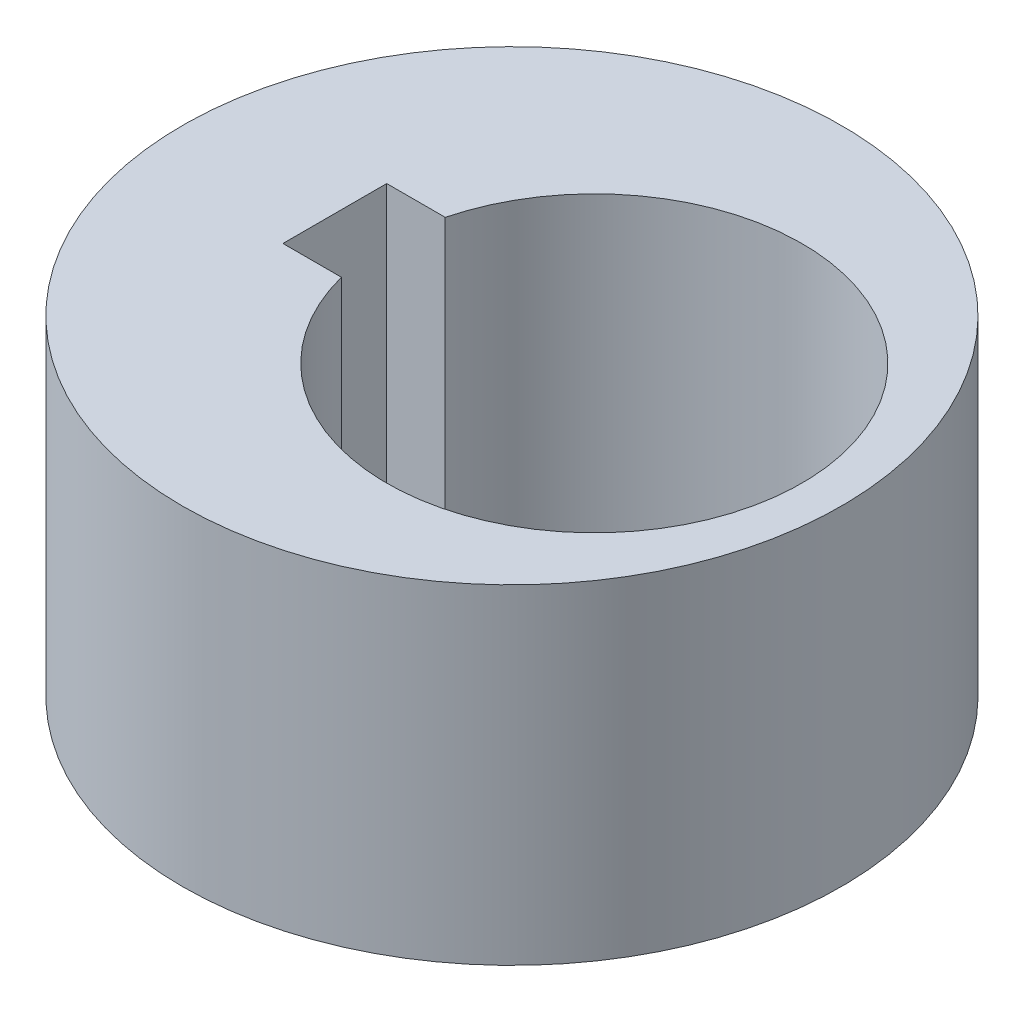
ISO-10303-21;
HEADER;
FILE_DESCRIPTION(('STEP AP214'),'2;1');
FILE_NAME('part.step','',(''),(''),'','','');
FILE_SCHEMA(('AUTOMOTIVE_DESIGN { 1 0 10303 214 1 1 1 1 }'));
ENDSEC;
DATA;
#1=APPLICATION_CONTEXT('core data for automotive mechanical design processes');
#2=APPLICATION_PROTOCOL_DEFINITION('international standard','automotive_design',2000,#1);
#3=PRODUCT_CONTEXT('',#1,'mechanical');
#4=PRODUCT('Part','Part','',(#3));
#5=PRODUCT_RELATED_PRODUCT_CATEGORY('part','',(#4));
#6=PRODUCT_DEFINITION_FORMATION('','',#4);
#7=PRODUCT_DEFINITION_CONTEXT('part definition',#1,'design');
#8=PRODUCT_DEFINITION('design','',#6,#7);
#9=PRODUCT_DEFINITION_SHAPE('','',#8);
#10=(LENGTH_UNIT() NAMED_UNIT(*) SI_UNIT(.MILLI.,.METRE.));
#11=(NAMED_UNIT(*) PLANE_ANGLE_UNIT() SI_UNIT($,.RADIAN.));
#12=(NAMED_UNIT(*) SI_UNIT($,.STERADIAN.) SOLID_ANGLE_UNIT());
#13=UNCERTAINTY_MEASURE_WITH_UNIT(LENGTH_MEASURE(1.E-05),#10,'distance_accuracy_value','');
#14=(GEOMETRIC_REPRESENTATION_CONTEXT(3) GLOBAL_UNCERTAINTY_ASSIGNED_CONTEXT((#13)) GLOBAL_UNIT_ASSIGNED_CONTEXT((#10,
#11,#12)) REPRESENTATION_CONTEXT('',''));
#15=CARTESIAN_POINT('',(0.,0.,0.));
#16=DIRECTION('',(0.,0.,1.));
#17=DIRECTION('',(1.,0.,0.));
#18=AXIS2_PLACEMENT_3D('',#15,#16,#17);
#19=CARTESIAN_POINT('',(0.,6.35,0.));
#20=DIRECTION('',(0.,-1.,0.));
#21=DIRECTION('',(0.,0.,-1.));
#22=AXIS2_PLACEMENT_3D('',#19,#20,#21);
#23=CYLINDRICAL_SURFACE('',#22,6.35);
#24=CARTESIAN_POINT('',(0.,6.35,0.));
#25=DIRECTION('',(0.,1.,0.));
#26=DIRECTION('',(0.,0.,1.));
#27=AXIS2_PLACEMENT_3D('',#24,#25,#26);
#28=CIRCLE('',#27,6.35);
#29=CARTESIAN_POINT('',(0.,6.35,6.35));
#30=VERTEX_POINT('',#29);
#31=EDGE_CURVE('E122',#30,#30,#28,.T.);
#32=ORIENTED_EDGE('',*,*,#31,.F.);
#33=EDGE_LOOP('',(#32));
#34=FACE_BOUND('',#33,.T.);
#35=CARTESIAN_POINT('',(0.,0.,0.));
#36=DIRECTION('',(0.,1.,0.));
#37=DIRECTION('',(0.,0.,1.));
#38=AXIS2_PLACEMENT_3D('',#35,#36,#37);
#39=CIRCLE('',#38,6.35);
#40=CARTESIAN_POINT('',(0.,0.,6.35));
#41=VERTEX_POINT('',#40);
#42=EDGE_CURVE('E118',#41,#41,#39,.T.);
#43=ORIENTED_EDGE('',*,*,#42,.T.);
#44=EDGE_LOOP('',(#43));
#45=FACE_BOUND('',#44,.T.);
#46=ADVANCED_FACE('F39',(#34,#45),#23,.T.);
#47=CARTESIAN_POINT('',(0.,6.35,0.));
#48=DIRECTION('',(0.,1.,0.));
#49=DIRECTION('',(0.,0.,1.));
#50=AXIS2_PLACEMENT_3D('',#47,#48,#49);
#51=PLANE('',#50);
#52=DIRECTION('',(1.,0.,0.));
#53=VECTOR('',#52,1.);
#54=CARTESIAN_POINT('',(-3.4125,6.35,1.));
#55=LINE('',#54,#53);
#56=CARTESIAN_POINT('',(-3.4125,6.35,1.));
#57=VERTEX_POINT('',#56);
#58=CARTESIAN_POINT('',(-2.28548334620742,6.35,1.));
#59=VERTEX_POINT('',#58);
#60=EDGE_CURVE('E101',#57,#59,#55,.T.);
#61=ORIENTED_EDGE('',*,*,#60,.F.);
#62=DIRECTION('',(0.,0.,1.));
#63=VECTOR('',#62,1.);
#64=CARTESIAN_POINT('',(-3.4125,6.35,1.));
#65=LINE('',#64,#63);
#66=CARTESIAN_POINT('',(-3.4125,6.35,-1.));
#67=VERTEX_POINT('',#66);
#68=EDGE_CURVE('E104',#67,#57,#65,.T.);
#69=ORIENTED_EDGE('',*,*,#68,.F.);
#70=DIRECTION('',(-1.,0.,0.));
#71=VECTOR('',#70,1.);
#72=CARTESIAN_POINT('',(-3.4125,6.35,-1.));
#73=LINE('',#72,#71);
#74=CARTESIAN_POINT('',(-2.28548334620742,6.35,-1.));
#75=VERTEX_POINT('',#74);
#76=EDGE_CURVE('E81',#75,#67,#73,.T.);
#77=ORIENTED_EDGE('',*,*,#76,.F.);
#78=CARTESIAN_POINT('',(1.5875,6.35,0.));
#79=DIRECTION('',(0.,1.,0.));
#80=DIRECTION('',(0.,0.,1.));
#81=AXIS2_PLACEMENT_3D('',#78,#79,#80);
#82=CIRCLE('',#81,4.);
#83=EDGE_CURVE('E114',#59,#75,#82,.T.);
#84=ORIENTED_EDGE('',*,*,#83,.F.);
#85=EDGE_LOOP('',(#61,#69,#77,#84));
#86=FACE_BOUND('',#85,.T.);
#87=ORIENTED_EDGE('',*,*,#31,.T.);
#88=EDGE_LOOP('',(#87));
#89=FACE_BOUND('',#88,.T.);
#90=ADVANCED_FACE('F134',(#86,#89),#51,.T.);
#91=CARTESIAN_POINT('',(0.,0.,0.));
#92=DIRECTION('',(0.,1.,0.));
#93=DIRECTION('',(0.,0.,1.));
#94=AXIS2_PLACEMENT_3D('',#91,#92,#93);
#95=PLANE('',#94);
#96=DIRECTION('',(0.,0.,1.));
#97=VECTOR('',#96,1.);
#98=CARTESIAN_POINT('',(-3.4125,0.,1.));
#99=LINE('',#98,#97);
#100=CARTESIAN_POINT('',(-3.4125,0.,-1.));
#101=VERTEX_POINT('',#100);
#102=CARTESIAN_POINT('',(-3.4125,0.,1.));
#103=VERTEX_POINT('',#102);
#104=EDGE_CURVE('E90',#101,#103,#99,.T.);
#105=ORIENTED_EDGE('',*,*,#104,.T.);
#106=DIRECTION('',(1.,0.,0.));
#107=VECTOR('',#106,1.);
#108=CARTESIAN_POINT('',(-3.4125,0.,1.));
#109=LINE('',#108,#107);
#110=CARTESIAN_POINT('',(-2.28548334620742,0.,1.));
#111=VERTEX_POINT('',#110);
#112=EDGE_CURVE('E87',#103,#111,#109,.T.);
#113=ORIENTED_EDGE('',*,*,#112,.T.);
#114=CARTESIAN_POINT('',(1.5875,0.,0.));
#115=DIRECTION('',(0.,1.,0.));
#116=DIRECTION('',(0.,0.,1.));
#117=AXIS2_PLACEMENT_3D('',#114,#115,#116);
#118=CIRCLE('',#117,4.);
#119=CARTESIAN_POINT('',(-2.28548334620742,0.,-1.));
#120=VERTEX_POINT('',#119);
#121=EDGE_CURVE('E99',#111,#120,#118,.T.);
#122=ORIENTED_EDGE('',*,*,#121,.T.);
#123=DIRECTION('',(-1.,0.,0.));
#124=VECTOR('',#123,1.);
#125=CARTESIAN_POINT('',(-3.4125,0.,-1.));
#126=LINE('',#125,#124);
#127=EDGE_CURVE('E54',#120,#101,#126,.T.);
#128=ORIENTED_EDGE('',*,*,#127,.T.);
#129=EDGE_LOOP('',(#105,#113,#122,#128));
#130=FACE_BOUND('',#129,.T.);
#131=ORIENTED_EDGE('',*,*,#42,.F.);
#132=EDGE_LOOP('',(#131));
#133=FACE_BOUND('',#132,.T.);
#134=ADVANCED_FACE('F96',(#130,#133),#95,.F.);
#135=CARTESIAN_POINT('',(1.5875,0.,0.));
#136=DIRECTION('',(0.,1.,0.));
#137=DIRECTION('',(0.,0.,1.));
#138=AXIS2_PLACEMENT_3D('',#135,#136,#137);
#139=CYLINDRICAL_SURFACE('',#138,4.);
#140=ORIENTED_EDGE('',*,*,#121,.F.);
#141=DIRECTION('',(0.,1.,0.));
#142=VECTOR('',#141,1.);
#143=CARTESIAN_POINT('',(-2.28548334620742,0.,1.));
#144=LINE('',#143,#142);
#145=EDGE_CURVE('E11',#111,#59,#144,.T.);
#146=ORIENTED_EDGE('',*,*,#145,.T.);
#147=ORIENTED_EDGE('',*,*,#83,.T.);
#148=DIRECTION('',(0.,1.,0.));
#149=VECTOR('',#148,1.);
#150=CARTESIAN_POINT('',(-2.28548334620742,0.,-1.));
#151=LINE('',#150,#149);
#152=EDGE_CURVE('E47',#75,#120,#151,.F.);
#153=ORIENTED_EDGE('',*,*,#152,.T.);
#154=EDGE_LOOP('',(#140,#146,#147,#153));
#155=FACE_BOUND('',#154,.T.);
#156=ADVANCED_FACE('F130',(#155),#139,.F.);
#157=CARTESIAN_POINT('',(-3.4125,0.,1.));
#158=DIRECTION('',(0.,0.,1.));
#159=DIRECTION('',(1.,0.,0.));
#160=AXIS2_PLACEMENT_3D('',#157,#158,#159);
#161=PLANE('',#160);
#162=ORIENTED_EDGE('',*,*,#112,.F.);
#163=DIRECTION('',(0.,1.,0.));
#164=VECTOR('',#163,1.);
#165=CARTESIAN_POINT('',(-3.4125,0.,1.));
#166=LINE('',#165,#164);
#167=EDGE_CURVE('E86',#103,#57,#166,.T.);
#168=ORIENTED_EDGE('',*,*,#167,.T.);
#169=ORIENTED_EDGE('',*,*,#60,.T.);
#170=ORIENTED_EDGE('',*,*,#145,.F.);
#171=EDGE_LOOP('',(#162,#168,#169,#170));
#172=FACE_BOUND('',#171,.T.);
#173=ADVANCED_FACE('F136',(#172),#161,.F.);
#174=CARTESIAN_POINT('',(-3.4125,0.,-1.));
#175=DIRECTION('',(0.,0.,-1.));
#176=DIRECTION('',(-1.,0.,0.));
#177=AXIS2_PLACEMENT_3D('',#174,#175,#176);
#178=PLANE('',#177);
#179=ORIENTED_EDGE('',*,*,#76,.T.);
#180=DIRECTION('',(0.,1.,0.));
#181=VECTOR('',#180,1.);
#182=CARTESIAN_POINT('',(-3.4125,0.,-1.));
#183=LINE('',#182,#181);
#184=EDGE_CURVE('E77',#101,#67,#183,.T.);
#185=ORIENTED_EDGE('',*,*,#184,.F.);
#186=ORIENTED_EDGE('',*,*,#127,.F.);
#187=ORIENTED_EDGE('',*,*,#152,.F.);
#188=EDGE_LOOP('',(#179,#185,#186,#187));
#189=FACE_BOUND('',#188,.T.);
#190=ADVANCED_FACE('F79',(#189),#178,.F.);
#191=CARTESIAN_POINT('',(-3.4125,0.,1.));
#192=DIRECTION('',(-1.,0.,0.));
#193=DIRECTION('',(0.,0.,1.));
#194=AXIS2_PLACEMENT_3D('',#191,#192,#193);
#195=PLANE('',#194);
#196=ORIENTED_EDGE('',*,*,#68,.T.);
#197=ORIENTED_EDGE('',*,*,#167,.F.);
#198=ORIENTED_EDGE('',*,*,#104,.F.);
#199=ORIENTED_EDGE('',*,*,#184,.T.);
#200=EDGE_LOOP('',(#196,#197,#198,#199));
#201=FACE_BOUND('',#200,.T.);
#202=ADVANCED_FACE('F91',(#201),#195,.F.);
#203=CLOSED_SHELL('',(#46,#90,#134,#156,#173,#190,#202));
#204=MANIFOLD_SOLID_BREP('B2',#203);
#205=ADVANCED_BREP_SHAPE_REPRESENTATION('',(#18,#204),#14);
#206=SHAPE_DEFINITION_REPRESENTATION(#9,#205);
ENDSEC;
END-ISO-10303-21;
